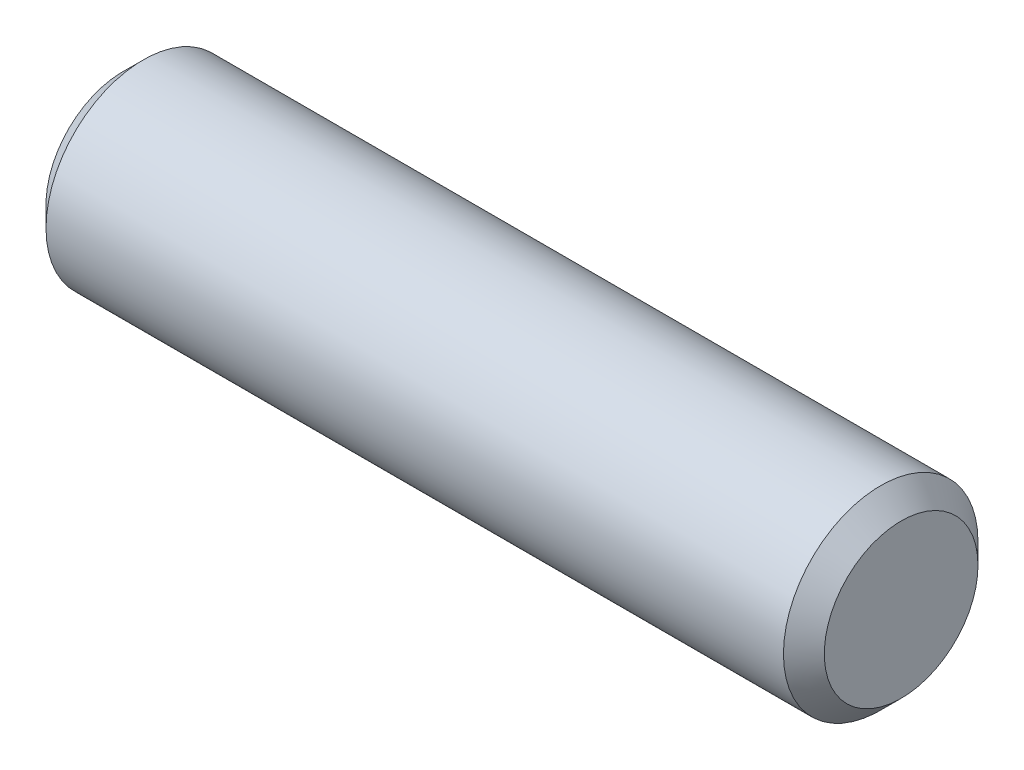
ISO-10303-21;
HEADER;
FILE_DESCRIPTION(('STEP AP214'),'2;1');
FILE_NAME('part.step','',(''),(''),'','','');
FILE_SCHEMA(('AUTOMOTIVE_DESIGN { 1 0 10303 214 1 1 1 1 }'));
ENDSEC;
DATA;
#1=APPLICATION_CONTEXT('core data for automotive mechanical design processes');
#2=APPLICATION_PROTOCOL_DEFINITION('international standard','automotive_design',2000,#1);
#3=PRODUCT_CONTEXT('',#1,'mechanical');
#4=PRODUCT('Part','Part','',(#3));
#5=PRODUCT_RELATED_PRODUCT_CATEGORY('part','',(#4));
#6=PRODUCT_DEFINITION_FORMATION('','',#4);
#7=PRODUCT_DEFINITION_CONTEXT('part definition',#1,'design');
#8=PRODUCT_DEFINITION('design','',#6,#7);
#9=PRODUCT_DEFINITION_SHAPE('','',#8);
#10=(LENGTH_UNIT() NAMED_UNIT(*) SI_UNIT(.MILLI.,.METRE.));
#11=(NAMED_UNIT(*) PLANE_ANGLE_UNIT() SI_UNIT($,.RADIAN.));
#12=(NAMED_UNIT(*) SI_UNIT($,.STERADIAN.) SOLID_ANGLE_UNIT());
#13=UNCERTAINTY_MEASURE_WITH_UNIT(LENGTH_MEASURE(1.E-05),#10,'distance_accuracy_value','');
#14=(GEOMETRIC_REPRESENTATION_CONTEXT(3) GLOBAL_UNCERTAINTY_ASSIGNED_CONTEXT((#13)) GLOBAL_UNIT_ASSIGNED_CONTEXT((#10,
#11,#12)) REPRESENTATION_CONTEXT('',''));
#15=CARTESIAN_POINT('',(0.,0.,0.));
#16=DIRECTION('',(0.,0.,1.));
#17=DIRECTION('',(1.,0.,0.));
#18=AXIS2_PLACEMENT_3D('',#15,#16,#17);
#19=CARTESIAN_POINT('',(4.7625,0.,0.));
#20=DIRECTION('',(-1.,0.,0.));
#21=DIRECTION('',(0.,0.,1.));
#22=AXIS2_PLACEMENT_3D('',#19,#20,#21);
#23=CYLINDRICAL_SURFACE('',#22,1.190625);
#24=CARTESIAN_POINT('',(-4.51249999999999,0.,0.));
#25=DIRECTION('',(1.,0.,0.));
#26=DIRECTION('',(0.,0.,-1.));
#27=AXIS2_PLACEMENT_3D('',#24,#25,#26);
#28=CIRCLE('',#27,1.190625);
#29=CARTESIAN_POINT('',(-4.51249999999999,0.,-1.190625));
#30=VERTEX_POINT('',#29);
#31=EDGE_CURVE('E42',#30,#30,#28,.T.);
#32=ORIENTED_EDGE('',*,*,#31,.T.);
#33=EDGE_LOOP('',(#32));
#34=FACE_BOUND('',#33,.T.);
#35=CARTESIAN_POINT('',(4.5125,0.,0.));
#36=DIRECTION('',(1.,0.,0.));
#37=DIRECTION('',(0.,0.,-1.));
#38=AXIS2_PLACEMENT_3D('',#35,#36,#37);
#39=CIRCLE('',#38,1.190625);
#40=CARTESIAN_POINT('',(4.5125,0.,-1.190625));
#41=VERTEX_POINT('',#40);
#42=EDGE_CURVE('E46',#41,#41,#39,.F.);
#43=ORIENTED_EDGE('',*,*,#42,.T.);
#44=EDGE_LOOP('',(#43));
#45=FACE_BOUND('',#44,.T.);
#46=ADVANCED_FACE('F31',(#34,#45),#23,.T.);
#47=CARTESIAN_POINT('',(4.7625,0.,0.));
#48=DIRECTION('',(1.,0.,0.));
#49=DIRECTION('',(0.,0.,-1.));
#50=AXIS2_PLACEMENT_3D('',#47,#48,#49);
#51=PLANE('',#50);
#52=CARTESIAN_POINT('',(4.7625,0.,0.));
#53=DIRECTION('',(1.,0.,0.));
#54=DIRECTION('',(0.,0.,-1.));
#55=AXIS2_PLACEMENT_3D('',#52,#53,#54);
#56=CIRCLE('',#55,0.940625000000005);
#57=CARTESIAN_POINT('',(4.7625,0.,-0.940625000000005));
#58=VERTEX_POINT('',#57);
#59=EDGE_CURVE('E10',#58,#58,#56,.T.);
#60=ORIENTED_EDGE('',*,*,#59,.T.);
#61=EDGE_LOOP('',(#60));
#62=FACE_BOUND('',#61,.T.);
#63=ADVANCED_FACE('F62',(#62),#51,.T.);
#64=CARTESIAN_POINT('',(-4.7625,0.,0.));
#65=DIRECTION('',(1.,0.,0.));
#66=DIRECTION('',(0.,0.,-1.));
#67=AXIS2_PLACEMENT_3D('',#64,#65,#66);
#68=PLANE('',#67);
#69=CARTESIAN_POINT('',(-4.7625,0.,0.));
#70=DIRECTION('',(1.,0.,0.));
#71=DIRECTION('',(0.,0.,-1.));
#72=AXIS2_PLACEMENT_3D('',#69,#70,#71);
#73=CIRCLE('',#72,0.940624999999992);
#74=CARTESIAN_POINT('',(-4.7625,0.,-0.940624999999992));
#75=VERTEX_POINT('',#74);
#76=EDGE_CURVE('E38',#75,#75,#73,.F.);
#77=ORIENTED_EDGE('',*,*,#76,.T.);
#78=EDGE_LOOP('',(#77));
#79=FACE_BOUND('',#78,.T.);
#80=ADVANCED_FACE('F59',(#79),#68,.F.);
#81=CARTESIAN_POINT('',(-4.51249999999999,0.,0.));
#82=DIRECTION('',(1.,0.,0.));
#83=DIRECTION('',(0.,0.,-1.));
#84=AXIS2_PLACEMENT_3D('',#81,#82,#83);
#85=CONICAL_SURFACE('',#84,1.190625,0.785398163397451);
#86=ORIENTED_EDGE('',*,*,#76,.F.);
#87=EDGE_LOOP('',(#86));
#88=FACE_BOUND('',#87,.T.);
#89=ORIENTED_EDGE('',*,*,#31,.F.);
#90=EDGE_LOOP('',(#89));
#91=FACE_BOUND('',#90,.T.);
#92=ADVANCED_FACE('F55',(#88,#91),#85,.T.);
#93=CARTESIAN_POINT('',(4.7625,0.,0.));
#94=DIRECTION('',(-1.,0.,0.));
#95=DIRECTION('',(0.,0.,1.));
#96=AXIS2_PLACEMENT_3D('',#93,#94,#95);
#97=CONICAL_SURFACE('',#96,0.940625000000005,0.785398163397446);
#98=ORIENTED_EDGE('',*,*,#42,.F.);
#99=EDGE_LOOP('',(#98));
#100=FACE_BOUND('',#99,.T.);
#101=ORIENTED_EDGE('',*,*,#59,.F.);
#102=EDGE_LOOP('',(#101));
#103=FACE_BOUND('',#102,.T.);
#104=ADVANCED_FACE('F33',(#100,#103),#97,.T.);
#105=CLOSED_SHELL('',(#46,#63,#80,#92,#104));
#106=MANIFOLD_SOLID_BREP('B2',#105);
#107=ADVANCED_BREP_SHAPE_REPRESENTATION('',(#18,#106),#14);
#108=SHAPE_DEFINITION_REPRESENTATION(#9,#107);
ENDSEC;
END-ISO-10303-21;
